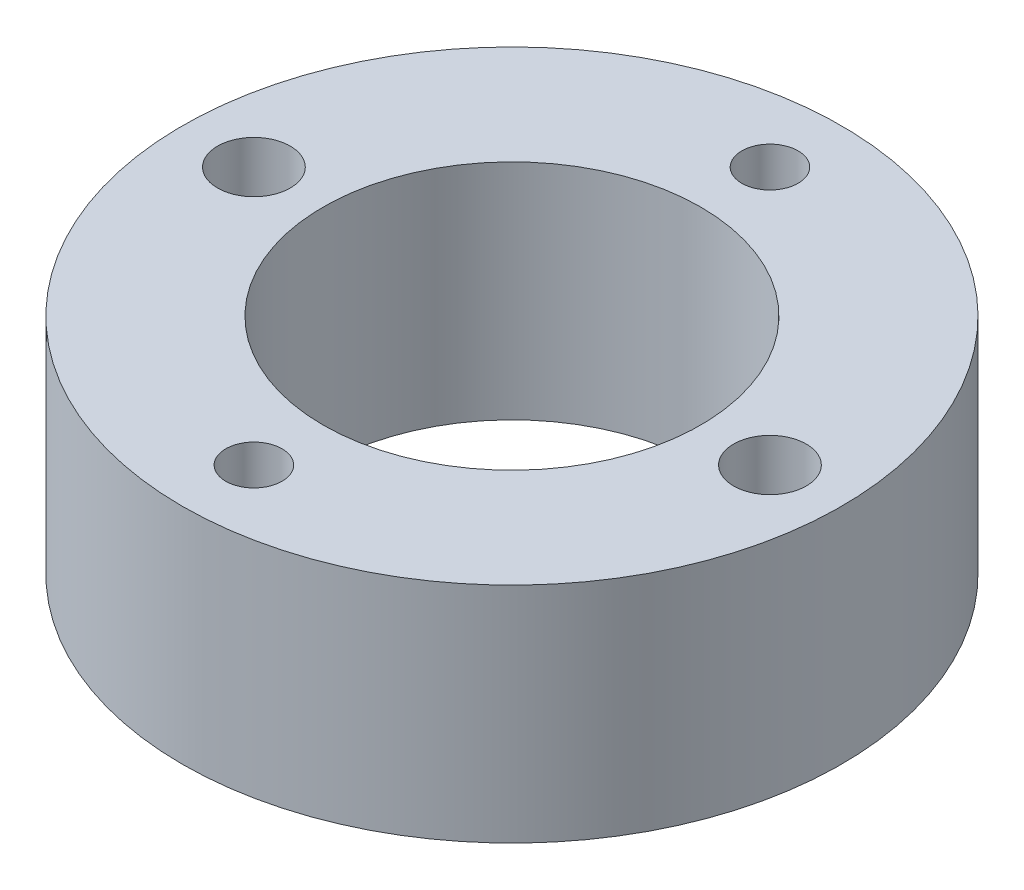
ISO-10303-21;
HEADER;
FILE_DESCRIPTION(('STEP AP214'),'2;1');
FILE_NAME('part.step','',(''),(''),'','','');
FILE_SCHEMA(('AUTOMOTIVE_DESIGN { 1 0 10303 214 1 1 1 1 }'));
ENDSEC;
DATA;
#1=APPLICATION_CONTEXT('core data for automotive mechanical design processes');
#2=APPLICATION_PROTOCOL_DEFINITION('international standard','automotive_design',2000,#1);
#3=PRODUCT_CONTEXT('',#1,'mechanical');
#4=PRODUCT('Part','Part','',(#3));
#5=PRODUCT_RELATED_PRODUCT_CATEGORY('part','',(#4));
#6=PRODUCT_DEFINITION_FORMATION('','',#4);
#7=PRODUCT_DEFINITION_CONTEXT('part definition',#1,'design');
#8=PRODUCT_DEFINITION('design','',#6,#7);
#9=PRODUCT_DEFINITION_SHAPE('','',#8);
#10=(LENGTH_UNIT() NAMED_UNIT(*) SI_UNIT(.MILLI.,.METRE.));
#11=(NAMED_UNIT(*) PLANE_ANGLE_UNIT() SI_UNIT($,.RADIAN.));
#12=(NAMED_UNIT(*) SI_UNIT($,.STERADIAN.) SOLID_ANGLE_UNIT());
#13=UNCERTAINTY_MEASURE_WITH_UNIT(LENGTH_MEASURE(1.E-05),#10,'distance_accuracy_value','');
#14=(GEOMETRIC_REPRESENTATION_CONTEXT(3) GLOBAL_UNCERTAINTY_ASSIGNED_CONTEXT((#13)) GLOBAL_UNIT_ASSIGNED_CONTEXT((#10,
#11,#12)) REPRESENTATION_CONTEXT('',''));
#15=CARTESIAN_POINT('',(0.,0.,0.));
#16=DIRECTION('',(0.,0.,1.));
#17=DIRECTION('',(1.,0.,0.));
#18=AXIS2_PLACEMENT_3D('',#15,#16,#17);
#19=CARTESIAN_POINT('',(0.,9.525,0.));
#20=DIRECTION('',(0.,1.,0.));
#21=DIRECTION('',(0.,0.,1.));
#22=AXIS2_PLACEMENT_3D('',#19,#20,#21);
#23=PLANE('',#22);
#24=CARTESIAN_POINT('',(0.,9.525,-11.));
#25=DIRECTION('',(0.,1.,0.));
#26=DIRECTION('',(0.,0.,1.));
#27=AXIS2_PLACEMENT_3D('',#24,#25,#26);
#28=CIRCLE('',#27,1.2);
#29=CARTESIAN_POINT('',(0.,9.525,-9.8));
#30=VERTEX_POINT('',#29);
#31=EDGE_CURVE('E78',#30,#30,#28,.T.);
#32=ORIENTED_EDGE('',*,*,#31,.F.);
#33=EDGE_LOOP('',(#32));
#34=FACE_BOUND('',#33,.T.);
#35=CARTESIAN_POINT('',(11.,9.525,0.));
#36=DIRECTION('',(0.,1.,0.));
#37=DIRECTION('',(0.,0.,1.));
#38=AXIS2_PLACEMENT_3D('',#35,#36,#37);
#39=CIRCLE('',#38,1.55);
#40=CARTESIAN_POINT('',(11.,9.525,1.55));
#41=VERTEX_POINT('',#40);
#42=EDGE_CURVE('E62',#41,#41,#39,.T.);
#43=ORIENTED_EDGE('',*,*,#42,.F.);
#44=EDGE_LOOP('',(#43));
#45=FACE_BOUND('',#44,.T.);
#46=CARTESIAN_POINT('',(0.,9.525,0.));
#47=DIRECTION('',(0.,1.,0.));
#48=DIRECTION('',(0.,0.,1.));
#49=AXIS2_PLACEMENT_3D('',#46,#47,#48);
#50=CIRCLE('',#49,14.05);
#51=CARTESIAN_POINT('',(0.,9.525,14.05));
#52=VERTEX_POINT('',#51);
#53=EDGE_CURVE('E10',#52,#52,#50,.T.);
#54=ORIENTED_EDGE('',*,*,#53,.T.);
#55=EDGE_LOOP('',(#54));
#56=FACE_BOUND('',#55,.T.);
#57=CARTESIAN_POINT('',(0.,9.525,0.));
#58=DIRECTION('',(0.,1.,0.));
#59=DIRECTION('',(0.,0.,1.));
#60=AXIS2_PLACEMENT_3D('',#57,#58,#59);
#61=CIRCLE('',#60,8.05);
#62=CARTESIAN_POINT('',(0.,9.525,8.05));
#63=VERTEX_POINT('',#62);
#64=EDGE_CURVE('E56',#63,#63,#61,.T.);
#65=ORIENTED_EDGE('',*,*,#64,.F.);
#66=EDGE_LOOP('',(#65));
#67=FACE_BOUND('',#66,.T.);
#68=CARTESIAN_POINT('',(-11.,9.525,0.));
#69=DIRECTION('',(0.,1.,0.));
#70=DIRECTION('',(0.,0.,1.));
#71=AXIS2_PLACEMENT_3D('',#68,#69,#70);
#72=CIRCLE('',#71,1.55);
#73=CARTESIAN_POINT('',(-11.,9.525,1.55));
#74=VERTEX_POINT('',#73);
#75=EDGE_CURVE('E70',#74,#74,#72,.T.);
#76=ORIENTED_EDGE('',*,*,#75,.F.);
#77=EDGE_LOOP('',(#76));
#78=FACE_BOUND('',#77,.T.);
#79=CARTESIAN_POINT('',(0.,9.525,11.));
#80=DIRECTION('',(0.,1.,0.));
#81=DIRECTION('',(0.,0.,1.));
#82=AXIS2_PLACEMENT_3D('',#79,#80,#81);
#83=CIRCLE('',#82,1.2);
#84=CARTESIAN_POINT('',(0.,9.525,12.2));
#85=VERTEX_POINT('',#84);
#86=EDGE_CURVE('E86',#85,#85,#83,.T.);
#87=ORIENTED_EDGE('',*,*,#86,.F.);
#88=EDGE_LOOP('',(#87));
#89=FACE_BOUND('',#88,.T.);
#90=ADVANCED_FACE('F43',(#34,#45,#56,#67,#78,#89),#23,.T.);
#91=CARTESIAN_POINT('',(0.,0.,0.));
#92=DIRECTION('',(0.,1.,0.));
#93=DIRECTION('',(0.,0.,1.));
#94=AXIS2_PLACEMENT_3D('',#91,#92,#93);
#95=PLANE('',#94);
#96=CARTESIAN_POINT('',(0.,0.,0.));
#97=DIRECTION('',(0.,1.,0.));
#98=DIRECTION('',(0.,0.,1.));
#99=AXIS2_PLACEMENT_3D('',#96,#97,#98);
#100=CIRCLE('',#99,14.05);
#101=CARTESIAN_POINT('',(0.,0.,14.05));
#102=VERTEX_POINT('',#101);
#103=EDGE_CURVE('E47',#102,#102,#100,.T.);
#104=ORIENTED_EDGE('',*,*,#103,.F.);
#105=EDGE_LOOP('',(#104));
#106=FACE_BOUND('',#105,.T.);
#107=CARTESIAN_POINT('',(0.,0.,0.));
#108=DIRECTION('',(0.,1.,0.));
#109=DIRECTION('',(0.,0.,1.));
#110=AXIS2_PLACEMENT_3D('',#107,#108,#109);
#111=CIRCLE('',#110,8.05);
#112=CARTESIAN_POINT('',(0.,0.,8.05));
#113=VERTEX_POINT('',#112);
#114=EDGE_CURVE('E58',#113,#113,#111,.T.);
#115=ORIENTED_EDGE('',*,*,#114,.T.);
#116=EDGE_LOOP('',(#115));
#117=FACE_BOUND('',#116,.T.);
#118=CARTESIAN_POINT('',(11.,0.,0.));
#119=DIRECTION('',(0.,1.,0.));
#120=DIRECTION('',(0.,0.,1.));
#121=AXIS2_PLACEMENT_3D('',#118,#119,#120);
#122=CIRCLE('',#121,1.55);
#123=CARTESIAN_POINT('',(11.,0.,1.55));
#124=VERTEX_POINT('',#123);
#125=EDGE_CURVE('E66',#124,#124,#122,.T.);
#126=ORIENTED_EDGE('',*,*,#125,.T.);
#127=EDGE_LOOP('',(#126));
#128=FACE_BOUND('',#127,.T.);
#129=CARTESIAN_POINT('',(-11.,0.,0.));
#130=DIRECTION('',(0.,1.,0.));
#131=DIRECTION('',(0.,0.,1.));
#132=AXIS2_PLACEMENT_3D('',#129,#130,#131);
#133=CIRCLE('',#132,1.55);
#134=CARTESIAN_POINT('',(-11.,0.,1.55));
#135=VERTEX_POINT('',#134);
#136=EDGE_CURVE('E74',#135,#135,#133,.T.);
#137=ORIENTED_EDGE('',*,*,#136,.T.);
#138=EDGE_LOOP('',(#137));
#139=FACE_BOUND('',#138,.T.);
#140=CARTESIAN_POINT('',(0.,0.,-11.));
#141=DIRECTION('',(0.,1.,0.));
#142=DIRECTION('',(0.,0.,1.));
#143=AXIS2_PLACEMENT_3D('',#140,#141,#142);
#144=CIRCLE('',#143,1.2);
#145=CARTESIAN_POINT('',(0.,0.,-9.8));
#146=VERTEX_POINT('',#145);
#147=EDGE_CURVE('E82',#146,#146,#144,.T.);
#148=ORIENTED_EDGE('',*,*,#147,.T.);
#149=EDGE_LOOP('',(#148));
#150=FACE_BOUND('',#149,.T.);
#151=CARTESIAN_POINT('',(0.,0.,11.));
#152=DIRECTION('',(0.,1.,0.));
#153=DIRECTION('',(0.,0.,1.));
#154=AXIS2_PLACEMENT_3D('',#151,#152,#153);
#155=CIRCLE('',#154,1.2);
#156=CARTESIAN_POINT('',(0.,0.,12.2));
#157=VERTEX_POINT('',#156);
#158=EDGE_CURVE('E90',#157,#157,#155,.T.);
#159=ORIENTED_EDGE('',*,*,#158,.T.);
#160=EDGE_LOOP('',(#159));
#161=FACE_BOUND('',#160,.T.);
#162=ADVANCED_FACE('F102',(#106,#117,#128,#139,#150,#161),#95,.F.);
#163=CARTESIAN_POINT('',(0.,9.525,0.));
#164=DIRECTION('',(0.,-1.,0.));
#165=DIRECTION('',(0.,0.,-1.));
#166=AXIS2_PLACEMENT_3D('',#163,#164,#165);
#167=CYLINDRICAL_SURFACE('',#166,14.05);
#168=ORIENTED_EDGE('',*,*,#53,.F.);
#169=EDGE_LOOP('',(#168));
#170=FACE_BOUND('',#169,.T.);
#171=ORIENTED_EDGE('',*,*,#103,.T.);
#172=EDGE_LOOP('',(#171));
#173=FACE_BOUND('',#172,.T.);
#174=ADVANCED_FACE('F45',(#170,#173),#167,.T.);
#175=CARTESIAN_POINT('',(0.,9.525,0.));
#176=DIRECTION('',(0.,-1.,0.));
#177=DIRECTION('',(0.,0.,-1.));
#178=AXIS2_PLACEMENT_3D('',#175,#176,#177);
#179=CYLINDRICAL_SURFACE('',#178,8.05);
#180=ORIENTED_EDGE('',*,*,#64,.T.);
#181=EDGE_LOOP('',(#180));
#182=FACE_BOUND('',#181,.T.);
#183=ORIENTED_EDGE('',*,*,#114,.F.);
#184=EDGE_LOOP('',(#183));
#185=FACE_BOUND('',#184,.T.);
#186=ADVANCED_FACE('F112',(#182,#185),#179,.F.);
#187=CARTESIAN_POINT('',(11.,9.525,0.));
#188=DIRECTION('',(0.,-1.,0.));
#189=DIRECTION('',(0.,0.,-1.));
#190=AXIS2_PLACEMENT_3D('',#187,#188,#189);
#191=CYLINDRICAL_SURFACE('',#190,1.55);
#192=ORIENTED_EDGE('',*,*,#42,.T.);
#193=EDGE_LOOP('',(#192));
#194=FACE_BOUND('',#193,.T.);
#195=ORIENTED_EDGE('',*,*,#125,.F.);
#196=EDGE_LOOP('',(#195));
#197=FACE_BOUND('',#196,.T.);
#198=ADVANCED_FACE('F115',(#194,#197),#191,.F.);
#199=CARTESIAN_POINT('',(-11.,9.525,0.));
#200=DIRECTION('',(0.,-1.,0.));
#201=DIRECTION('',(0.,0.,-1.));
#202=AXIS2_PLACEMENT_3D('',#199,#200,#201);
#203=CYLINDRICAL_SURFACE('',#202,1.55);
#204=ORIENTED_EDGE('',*,*,#75,.T.);
#205=EDGE_LOOP('',(#204));
#206=FACE_BOUND('',#205,.T.);
#207=ORIENTED_EDGE('',*,*,#136,.F.);
#208=EDGE_LOOP('',(#207));
#209=FACE_BOUND('',#208,.T.);
#210=ADVANCED_FACE('F119',(#206,#209),#203,.F.);
#211=CARTESIAN_POINT('',(0.,9.525,-11.));
#212=DIRECTION('',(0.,-1.,0.));
#213=DIRECTION('',(0.,0.,-1.));
#214=AXIS2_PLACEMENT_3D('',#211,#212,#213);
#215=CYLINDRICAL_SURFACE('',#214,1.2);
#216=ORIENTED_EDGE('',*,*,#31,.T.);
#217=EDGE_LOOP('',(#216));
#218=FACE_BOUND('',#217,.T.);
#219=ORIENTED_EDGE('',*,*,#147,.F.);
#220=EDGE_LOOP('',(#219));
#221=FACE_BOUND('',#220,.T.);
#222=ADVANCED_FACE('F123',(#218,#221),#215,.F.);
#223=CARTESIAN_POINT('',(0.,9.525,11.));
#224=DIRECTION('',(0.,-1.,0.));
#225=DIRECTION('',(0.,0.,-1.));
#226=AXIS2_PLACEMENT_3D('',#223,#224,#225);
#227=CYLINDRICAL_SURFACE('',#226,1.2);
#228=ORIENTED_EDGE('',*,*,#86,.T.);
#229=EDGE_LOOP('',(#228));
#230=FACE_BOUND('',#229,.T.);
#231=ORIENTED_EDGE('',*,*,#158,.F.);
#232=EDGE_LOOP('',(#231));
#233=FACE_BOUND('',#232,.T.);
#234=ADVANCED_FACE('F98',(#230,#233),#227,.F.);
#235=CLOSED_SHELL('',(#90,#162,#174,#186,#198,#210,#222,#234));
#236=MANIFOLD_SOLID_BREP('B2',#235);
#237=ADVANCED_BREP_SHAPE_REPRESENTATION('',(#18,#236),#14);
#238=SHAPE_DEFINITION_REPRESENTATION(#9,#237);
ENDSEC;
END-ISO-10303-21;
